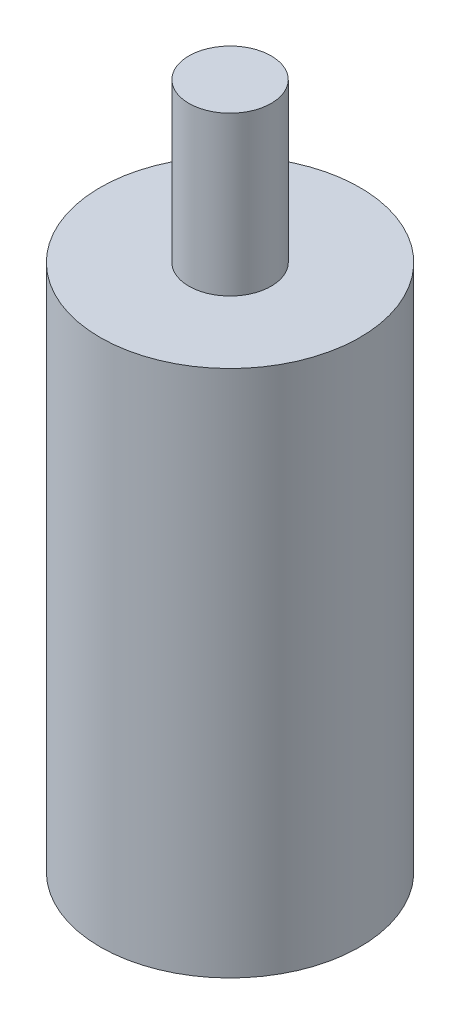
ISO-10303-21;
HEADER;
FILE_DESCRIPTION(('STEP AP214'),'2;1');
FILE_NAME('part.step','',(''),(''),'','','');
FILE_SCHEMA(('AUTOMOTIVE_DESIGN { 1 0 10303 214 1 1 1 1 }'));
ENDSEC;
DATA;
#1=APPLICATION_CONTEXT('core data for automotive mechanical design processes');
#2=APPLICATION_PROTOCOL_DEFINITION('international standard','automotive_design',2000,#1);
#3=PRODUCT_CONTEXT('',#1,'mechanical');
#4=PRODUCT('Part','Part','',(#3));
#5=PRODUCT_RELATED_PRODUCT_CATEGORY('part','',(#4));
#6=PRODUCT_DEFINITION_FORMATION('','',#4);
#7=PRODUCT_DEFINITION_CONTEXT('part definition',#1,'design');
#8=PRODUCT_DEFINITION('design','',#6,#7);
#9=PRODUCT_DEFINITION_SHAPE('','',#8);
#10=(LENGTH_UNIT() NAMED_UNIT(*) SI_UNIT(.MILLI.,.METRE.));
#11=(NAMED_UNIT(*) PLANE_ANGLE_UNIT() SI_UNIT($,.RADIAN.));
#12=(NAMED_UNIT(*) SI_UNIT($,.STERADIAN.) SOLID_ANGLE_UNIT());
#13=UNCERTAINTY_MEASURE_WITH_UNIT(LENGTH_MEASURE(1.E-05),#10,'distance_accuracy_value','');
#14=(GEOMETRIC_REPRESENTATION_CONTEXT(3) GLOBAL_UNCERTAINTY_ASSIGNED_CONTEXT((#13)) GLOBAL_UNIT_ASSIGNED_CONTEXT((#10,
#11,#12)) REPRESENTATION_CONTEXT('',''));
#15=CARTESIAN_POINT('',(0.,0.,0.));
#16=DIRECTION('',(0.,0.,1.));
#17=DIRECTION('',(1.,0.,0.));
#18=AXIS2_PLACEMENT_3D('',#15,#16,#17);
#19=CARTESIAN_POINT('',(2.05199399174836,-10.,-1.35926971218866));
#20=DIRECTION('',(0.,1.,0.));
#21=DIRECTION('',(0.,0.,1.));
#22=AXIS2_PLACEMENT_3D('',#19,#20,#21);
#23=CYLINDRICAL_SURFACE('',#22,2.46136009);
#24=CARTESIAN_POINT('',(2.05199399174836,-10.,-1.35926971218866));
#25=DIRECTION('',(0.,1.,0.));
#26=DIRECTION('',(0.,0.,1.));
#27=AXIS2_PLACEMENT_3D('',#24,#25,#26);
#28=CIRCLE('',#27,2.46136009);
#29=CARTESIAN_POINT('',(2.05199399174836,-10.,1.10209037781134));
#30=VERTEX_POINT('',#29);
#31=EDGE_CURVE('E12',#30,#30,#28,.T.);
#32=ORIENTED_EDGE('',*,*,#31,.T.);
#33=EDGE_LOOP('',(#32));
#34=FACE_BOUND('',#33,.T.);
#35=CARTESIAN_POINT('',(2.05199399174836,0.,-1.35926971218866));
#36=DIRECTION('',(0.,1.,0.));
#37=DIRECTION('',(0.,0.,1.));
#38=AXIS2_PLACEMENT_3D('',#35,#36,#37);
#39=CIRCLE('',#38,2.46136009);
#40=CARTESIAN_POINT('',(2.05199399174836,0.,1.10209037781134));
#41=VERTEX_POINT('',#40);
#42=EDGE_CURVE('E48',#41,#41,#39,.T.);
#43=ORIENTED_EDGE('',*,*,#42,.F.);
#44=EDGE_LOOP('',(#43));
#45=FACE_BOUND('',#44,.T.);
#46=ADVANCED_FACE('F45',(#34,#45),#23,.T.);
#47=CARTESIAN_POINT('',(2.05199399174836,-10.,-1.35926971218866));
#48=DIRECTION('',(0.,1.,0.));
#49=DIRECTION('',(0.,0.,1.));
#50=AXIS2_PLACEMENT_3D('',#47,#48,#49);
#51=PLANE('',#50);
#52=CARTESIAN_POINT('',(2.05199399174836,-10.,-1.35926971218866));
#53=DIRECTION('',(0.,1.,0.));
#54=DIRECTION('',(0.,0.,1.));
#55=AXIS2_PLACEMENT_3D('',#52,#53,#54);
#56=CIRCLE('',#55,0.78);
#57=CARTESIAN_POINT('',(2.05199399174836,-10.,-0.579269712188664));
#58=VERTEX_POINT('',#57);
#59=EDGE_CURVE('E55',#58,#58,#56,.T.);
#60=ORIENTED_EDGE('',*,*,#59,.T.);
#61=EDGE_LOOP('',(#60));
#62=FACE_BOUND('',#61,.T.);
#63=ORIENTED_EDGE('',*,*,#31,.F.);
#64=EDGE_LOOP('',(#63));
#65=FACE_BOUND('',#64,.T.);
#66=ADVANCED_FACE('F63',(#62,#65),#51,.F.);
#67=CARTESIAN_POINT('',(2.05199399174836,0.,-1.35926971218866));
#68=DIRECTION('',(0.,1.,0.));
#69=DIRECTION('',(0.,0.,1.));
#70=AXIS2_PLACEMENT_3D('',#67,#68,#69);
#71=PLANE('',#70);
#72=CARTESIAN_POINT('',(2.05199399174836,0.,-1.35926971218866));
#73=DIRECTION('',(0.,1.,0.));
#74=DIRECTION('',(0.,0.,1.));
#75=AXIS2_PLACEMENT_3D('',#72,#73,#74);
#76=CIRCLE('',#75,0.78);
#77=CARTESIAN_POINT('',(2.05199399174836,0.,-0.579269712188664));
#78=VERTEX_POINT('',#77);
#79=EDGE_CURVE('E57',#78,#78,#76,.T.);
#80=ORIENTED_EDGE('',*,*,#79,.F.);
#81=EDGE_LOOP('',(#80));
#82=FACE_BOUND('',#81,.T.);
#83=ORIENTED_EDGE('',*,*,#42,.T.);
#84=EDGE_LOOP('',(#83));
#85=FACE_BOUND('',#84,.T.);
#86=ADVANCED_FACE('F69',(#82,#85),#71,.T.);
#87=CARTESIAN_POINT('',(2.05199399174836,-10.,-1.35926971218866));
#88=DIRECTION('',(0.,1.,0.));
#89=DIRECTION('',(0.,0.,1.));
#90=AXIS2_PLACEMENT_3D('',#87,#88,#89);
#91=CYLINDRICAL_SURFACE('',#90,0.78);
#92=ORIENTED_EDGE('',*,*,#59,.F.);
#93=EDGE_LOOP('',(#92));
#94=FACE_BOUND('',#93,.T.);
#95=ORIENTED_EDGE('',*,*,#79,.T.);
#96=EDGE_LOOP('',(#95));
#97=FACE_BOUND('',#96,.T.);
#98=ADVANCED_FACE('F66',(#94,#97),#91,.F.);
#99=CLOSED_SHELL('',(#46,#66,#86,#98));
#100=MANIFOLD_SOLID_BREP('B2',#99);
#101=CARTESIAN_POINT('',(0.,0.,0.));
#102=DIRECTION('',(0.,1.,0.));
#103=DIRECTION('',(0.,0.,1.));
#104=AXIS2_PLACEMENT_3D('',#101,#102,#103);
#105=PLANE('',#104);
#106=CARTESIAN_POINT('',(2.05199399174836,0.,-1.35926971218866));
#107=DIRECTION('',(0.,1.,0.));
#108=DIRECTION('',(0.,0.,1.));
#109=AXIS2_PLACEMENT_3D('',#106,#107,#108);
#110=CIRCLE('',#109,0.78);
#111=CARTESIAN_POINT('',(2.05199399174836,0.,-0.579269712188664));
#112=VERTEX_POINT('',#111);
#113=EDGE_CURVE('E111',#112,#112,#110,.T.);
#114=ORIENTED_EDGE('',*,*,#113,.F.);
#115=EDGE_LOOP('',(#114));
#116=FACE_BOUND('',#115,.T.);
#117=ADVANCED_FACE('F107',(#116),#105,.F.);
#118=CARTESIAN_POINT('',(2.05199399174836,3.,-1.35926971218866));
#119=DIRECTION('',(0.,-1.,0.));
#120=DIRECTION('',(0.,0.,-1.));
#121=AXIS2_PLACEMENT_3D('',#118,#119,#120);
#122=CYLINDRICAL_SURFACE('',#121,0.78);
#123=CARTESIAN_POINT('',(2.05199399174836,3.,-1.35926971218866));
#124=DIRECTION('',(0.,1.,0.));
#125=DIRECTION('',(0.,0.,1.));
#126=AXIS2_PLACEMENT_3D('',#123,#124,#125);
#127=CIRCLE('',#126,0.78);
#128=CARTESIAN_POINT('',(2.05199399174836,3.,-0.579269712188664));
#129=VERTEX_POINT('',#128);
#130=EDGE_CURVE('E44',#129,#129,#127,.T.);
#131=ORIENTED_EDGE('',*,*,#130,.F.);
#132=EDGE_LOOP('',(#131));
#133=FACE_BOUND('',#132,.T.);
#134=ORIENTED_EDGE('',*,*,#113,.T.);
#135=EDGE_LOOP('',(#134));
#136=FACE_BOUND('',#135,.T.);
#137=ADVANCED_FACE('F109',(#133,#136),#122,.T.);
#138=CARTESIAN_POINT('',(0.,3.,0.));
#139=DIRECTION('',(0.,1.,0.));
#140=DIRECTION('',(0.,0.,1.));
#141=AXIS2_PLACEMENT_3D('',#138,#139,#140);
#142=PLANE('',#141);
#143=ORIENTED_EDGE('',*,*,#130,.T.);
#144=EDGE_LOOP('',(#143));
#145=FACE_BOUND('',#144,.T.);
#146=ADVANCED_FACE('F122',(#145),#142,.T.);
#147=CLOSED_SHELL('',(#117,#137,#146));
#148=MANIFOLD_SOLID_BREP('B7',#147);
#149=ADVANCED_BREP_SHAPE_REPRESENTATION('',(#18,#100,#148),#14);
#150=SHAPE_DEFINITION_REPRESENTATION(#9,#149);
ENDSEC;
END-ISO-10303-21;
